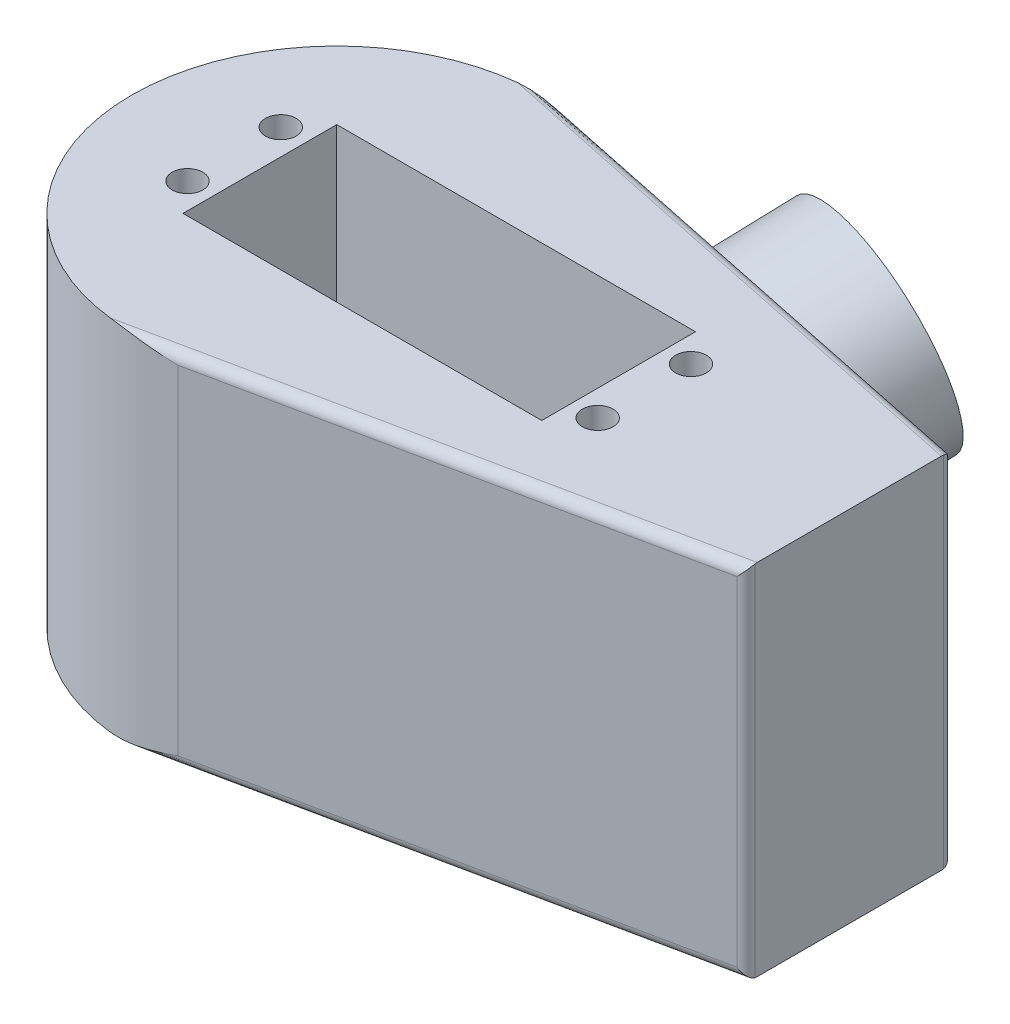
ISO-10303-21;
HEADER;
FILE_DESCRIPTION(('STEP AP214'),'2;1');
FILE_NAME('part.step','',(''),(''),'','','');
FILE_SCHEMA(('AUTOMOTIVE_DESIGN { 1 0 10303 214 1 1 1 1 }'));
ENDSEC;
DATA;
#1=APPLICATION_CONTEXT('core data for automotive mechanical design processes');
#2=APPLICATION_PROTOCOL_DEFINITION('international standard','automotive_design',2000,#1);
#3=PRODUCT_CONTEXT('',#1,'mechanical');
#4=PRODUCT('Part','Part','',(#3));
#5=PRODUCT_RELATED_PRODUCT_CATEGORY('part','',(#4));
#6=PRODUCT_DEFINITION_FORMATION('','',#4);
#7=PRODUCT_DEFINITION_CONTEXT('part definition',#1,'design');
#8=PRODUCT_DEFINITION('design','',#6,#7);
#9=PRODUCT_DEFINITION_SHAPE('','',#8);
#10=(LENGTH_UNIT() NAMED_UNIT(*) SI_UNIT(.MILLI.,.METRE.));
#11=(NAMED_UNIT(*) PLANE_ANGLE_UNIT() SI_UNIT($,.RADIAN.));
#12=(NAMED_UNIT(*) SI_UNIT($,.STERADIAN.) SOLID_ANGLE_UNIT());
#13=UNCERTAINTY_MEASURE_WITH_UNIT(LENGTH_MEASURE(1.E-05),#10,'distance_accuracy_value','');
#14=(GEOMETRIC_REPRESENTATION_CONTEXT(3) GLOBAL_UNCERTAINTY_ASSIGNED_CONTEXT((#13)) GLOBAL_UNIT_ASSIGNED_CONTEXT((#10,
#11,#12)) REPRESENTATION_CONTEXT('',''));
#15=CARTESIAN_POINT('',(0.,0.,0.));
#16=DIRECTION('',(0.,0.,1.));
#17=DIRECTION('',(1.,0.,0.));
#18=AXIS2_PLACEMENT_3D('',#15,#16,#17);
#19=CARTESIAN_POINT('',(0.,35.,-55.));
#20=DIRECTION('',(0.,-1.,0.));
#21=DIRECTION('',(0.,0.,1.));
#22=AXIS2_PLACEMENT_3D('',#19,#20,#21);
#23=CYLINDRICAL_SURFACE('',#22,20.);
#24=CARTESIAN_POINT('',(0.,35.,-55.));
#25=DIRECTION('',(0.,-1.,0.));
#26=DIRECTION('',(0.,0.,-1.));
#27=AXIS2_PLACEMENT_3D('',#24,#25,#26);
#28=CIRCLE('',#27,20.);
#29=CARTESIAN_POINT('',(-2.2333107920081,35.,-35.1250830717132));
#30=VERTEX_POINT('',#29);
#31=CARTESIAN_POINT('',(-2.23331079200801,35.,-74.8749169282868));
#32=VERTEX_POINT('',#31);
#33=EDGE_CURVE('E191',#30,#32,#28,.T.);
#34=ORIENTED_EDGE('',*,*,#33,.T.);
#35=CARTESIAN_POINT('',(-2.23331079200801,35.,-74.8749169282868));
#36=CARTESIAN_POINT('',(-2.14996907357093,34.9999950767671,-74.8842821194228));
#37=CARTESIAN_POINT('',(-2.06657545336633,34.998971904392,-74.8931218404145));
#38=CARTESIAN_POINT('',(-1.89973454127592,34.9950834396215,-74.9097472148043));
#39=CARTESIAN_POINT('',(-1.81628725619466,34.9922183470936,-74.9175329824564));
#40=CARTESIAN_POINT('',(-1.56602084017878,34.9811560983058,-74.9392981586653));
#41=CARTESIAN_POINT('',(-1.39916930294379,34.9704914609071,-74.9516975519698));
#42=CARTESIAN_POINT('',(-1.06584594714328,34.9437956167236,-74.9722764466726));
#43=CARTESIAN_POINT('',(-0.899373912551401,34.9277705786574,-74.9804607713778));
#44=CARTESIAN_POINT('',(-0.566738303897362,34.8912643836756,-74.9926616357295));
#45=CARTESIAN_POINT('',(-0.400574812968888,34.8707821637801,-74.9966771798555));
#46=CARTESIAN_POINT('',(0.128809122322126,34.7995709639234,-75.0028867233304));
#47=CARTESIAN_POINT('',(0.491220352464049,34.7418534786272,-74.99722650781));
#48=CARTESIAN_POINT('',(1.21313243878922,34.614782264799,-74.9664467676819));
#49=CARTESIAN_POINT('',(1.5726320780209,34.5454239097815,-74.9413194917747));
#50=CARTESIAN_POINT('',(2.64646781571053,34.326563565978,-74.8371721412846));
#51=CARTESIAN_POINT('',(3.35617771041687,34.1662703511847,-74.7293869136484));
#52=CARTESIAN_POINT('',(4.06628044528317,34.0041146958639,-74.5822738180682));
#53=CARTESIAN_POINT('',(4.07528872144488,34.0020573163571,-74.5804010779713));
#54=CARTESIAN_POINT('',(4.08429556936663,34.,-74.5785221531671));
#55=B_SPLINE_CURVE_WITH_KNOTS('',3,(#35,#36,#37,#38,#39,#40,#41,#42,#43,#44,#45,#46,#47,#48,#49,
#50,#51,#52,#53,#54),.UNSPECIFIED.,.F.,.F.,(4,2,2,2,2,2,2,2,2,4),(0.,0.251579466840216,
0.503131639289502,1.00591075695084,1.50811325849014,2.01043566031304,3.11052898446647,
4.21106056370253,6.41201196552981,6.44029624320447),.UNSPECIFIED.);
#56=CARTESIAN_POINT('',(4.08429556936663,34.,-74.5785221531671));
#57=VERTEX_POINT('',#56);
#58=EDGE_CURVE('E244',#57,#32,#55,.F.);
#59=ORIENTED_EDGE('',*,*,#58,.F.);
#60=DIRECTION('',(0.,-1.,0.));
#61=VECTOR('',#60,1.);
#62=CARTESIAN_POINT('',(4.08429556936663,35.,-74.5785221531671));
#63=LINE('',#62,#61);
#64=CARTESIAN_POINT('',(4.08429556936663,1.,-74.5785221531671));
#65=VERTEX_POINT('',#64);
#66=EDGE_CURVE('E205',#57,#65,#63,.T.);
#67=ORIENTED_EDGE('',*,*,#66,.T.);
#68=CARTESIAN_POINT('',(-2.23331079200801,0.,-74.8749169282868));
#69=CARTESIAN_POINT('',(-2.14996907357087,4.92323291417513E-06,-74.8842821194228));
#70=CARTESIAN_POINT('',(-2.0665754533662,0.00102809560798269,-74.8931218404145));
#71=CARTESIAN_POINT('',(-1.89973454127567,0.00491656037851031,-74.9097472148043));
#72=CARTESIAN_POINT('',(-1.81628725619435,0.00778165290641086,-74.9175329824564));
#73=CARTESIAN_POINT('',(-1.56602084017831,0.0188439016942182,-74.9392981586653));
#74=CARTESIAN_POINT('',(-1.39916930294322,0.0295085390929364,-74.9516975519699));
#75=CARTESIAN_POINT('',(-1.06584594714274,0.0562043832764797,-74.9722764466726));
#76=CARTESIAN_POINT('',(-0.899373912550977,0.0722294213426533,-74.9804607713778));
#77=CARTESIAN_POINT('',(-0.566738303897156,0.10873561632441,-74.9926616357295));
#78=CARTESIAN_POINT('',(-0.400574812968779,0.129217836219925,-74.9966771798555));
#79=CARTESIAN_POINT('',(0.128809122322075,0.20042903607671,-75.0028867233304));
#80=CARTESIAN_POINT('',(0.491220352463882,0.2581465213732,-74.99722650781));
#81=CARTESIAN_POINT('',(1.21313243878911,0.385217735200488,-74.9664467676819));
#82=CARTESIAN_POINT('',(1.57263207802098,0.454576090216708,-74.9413194917747));
#83=CARTESIAN_POINT('',(2.64646781570953,0.67343643402529,-74.8371721412847));
#84=CARTESIAN_POINT('',(3.35617771041266,0.833729648833808,-74.729386913649));
#85=CARTESIAN_POINT('',(4.06628044528312,0.995885304136537,-74.5822738180682));
#86=CARTESIAN_POINT('',(4.07528872144487,0.997942683643127,-74.5804010779713));
#87=CARTESIAN_POINT('',(4.08429556936667,1.,-74.5785221531671));
#88=B_SPLINE_CURVE_WITH_KNOTS('',3,(#68,#69,#70,#71,#72,#73,#74,#75,#76,#77,#78,#79,#80,#81,#82,
#83,#84,#85,#86,#87),.UNSPECIFIED.,.F.,.F.,(4,2,2,2,2,2,2,2,2,4),(0.,0.251579466840405,
0.503131639289877,1.00591075695151,1.50811325849045,2.01043566031304,3.11052898446636,
4.21106056370212,6.41201196552987,6.4402962432045),.UNSPECIFIED.);
#89=CARTESIAN_POINT('',(-2.23331079200801,0.,-74.8749169282868));
#90=VERTEX_POINT('',#89);
#91=EDGE_CURVE('E236',#90,#65,#88,.T.);
#92=ORIENTED_EDGE('',*,*,#91,.F.);
#93=CARTESIAN_POINT('',(0.,0.,-55.));
#94=DIRECTION('',(0.,-1.,0.));
#95=DIRECTION('',(0.,0.,-1.));
#96=AXIS2_PLACEMENT_3D('',#93,#94,#95);
#97=CIRCLE('',#96,20.);
#98=CARTESIAN_POINT('',(-2.2333107920081,0.,-35.1250830717132));
#99=VERTEX_POINT('',#98);
#100=EDGE_CURVE('E187',#99,#90,#97,.T.);
#101=ORIENTED_EDGE('',*,*,#100,.F.);
#102=CARTESIAN_POINT('',(-2.2333107920081,0.,-35.1250830717132));
#103=CARTESIAN_POINT('',(-2.14996907357066,4.92323291338114E-06,-35.1157178805772));
#104=CARTESIAN_POINT('',(-2.06657545336569,0.00102809560798992,-35.1068781595855));
#105=CARTESIAN_POINT('',(-1.89973454127456,0.00491656037854607,-35.0902527851956));
#106=CARTESIAN_POINT('',(-1.81628725619293,0.00778165290646713,-35.0824670175435));
#107=CARTESIAN_POINT('',(-1.56602084017612,0.018843901694341,-35.0607018413345));
#108=CARTESIAN_POINT('',(-1.39916930294056,0.0295085390931108,-35.04830244803));
#109=CARTESIAN_POINT('',(-1.06584594714019,0.056204383276741,-35.0277235533272));
#110=CARTESIAN_POINT('',(-0.899373912549017,0.072229421342916,-35.0195392286221));
#111=CARTESIAN_POINT('',(-0.566738303896248,0.108735616324489,-35.0073383642705));
#112=CARTESIAN_POINT('',(-0.400574812968337,0.129217836219819,-35.0033228201445));
#113=CARTESIAN_POINT('',(0.128809122321731,0.20042903607708,-34.9971132766696));
#114=CARTESIAN_POINT('',(0.491220352462968,0.258146521375392,-35.0027734921899));
#115=CARTESIAN_POINT('',(1.21313243878852,0.385217735198099,-35.0335532323182));
#116=CARTESIAN_POINT('',(1.57263207802129,0.454576090207902,-35.0586805082257));
#117=CARTESIAN_POINT('',(2.64646781570446,0.673436434042161,-35.1628278587141));
#118=CARTESIAN_POINT('',(3.35617771039161,0.833729648927437,-35.2706130863458));
#119=CARTESIAN_POINT('',(4.06628044528254,0.995885304138937,-35.4177261819317));
#120=CARTESIAN_POINT('',(4.07528872144455,0.997942683644341,-35.4195989220287));
#121=CARTESIAN_POINT('',(4.08429556936661,1.,-35.4214778468329));
#122=B_SPLINE_CURVE_WITH_KNOTS('',3,(#102,#103,#104,#105,#106,#107,#108,#109,#110,#111,#112,
#113,#114,#115,#116,#117,#118,#119,#120,#121),.UNSPECIFIED.,.F.,.F.,(4,2,2,2,2,2,2,2,2,4),(0.,
0.251579466841312,0.503131639291695,1.00591075695474,1.50811325849194,2.01043566031304,
3.11052898446585,4.21106056370015,6.41201196552988,6.44029624320452),.UNSPECIFIED.);
#123=CARTESIAN_POINT('',(4.08429556936661,1.,-35.4214778468329));
#124=VERTEX_POINT('',#123);
#125=EDGE_CURVE('E264',#124,#99,#122,.F.);
#126=ORIENTED_EDGE('',*,*,#125,.F.);
#127=DIRECTION('',(0.,-1.,0.));
#128=VECTOR('',#127,1.);
#129=CARTESIAN_POINT('',(4.08429556936661,35.,-35.4214778468329));
#130=LINE('',#129,#128);
#131=CARTESIAN_POINT('',(4.08429556936661,34.,-35.4214778468329));
#132=VERTEX_POINT('',#131);
#133=EDGE_CURVE('E198',#132,#124,#130,.T.);
#134=ORIENTED_EDGE('',*,*,#133,.F.);
#135=CARTESIAN_POINT('',(-2.2333107920081,35.,-35.1250830717132));
#136=CARTESIAN_POINT('',(-2.14996907357066,34.9999950767671,-35.1157178805772));
#137=CARTESIAN_POINT('',(-2.06657545336571,34.998971904392,-35.1068781595855));
#138=CARTESIAN_POINT('',(-1.89973454127459,34.9950834396215,-35.0902527851956));
#139=CARTESIAN_POINT('',(-1.81628725619297,34.9922183470935,-35.0824670175435));
#140=CARTESIAN_POINT('',(-1.56602084017618,34.9811560983057,-35.0607018413345));
#141=CARTESIAN_POINT('',(-1.39916930294064,34.9704914609069,-35.04830244803));
#142=CARTESIAN_POINT('',(-1.06584594714026,34.9437956167233,-35.0277235533273));
#143=CARTESIAN_POINT('',(-0.899373912549073,34.9277705786571,-35.0195392286221));
#144=CARTESIAN_POINT('',(-0.566738303896276,34.8912643836755,-35.0073383642705));
#145=CARTESIAN_POINT('',(-0.400574812968352,34.8707821637802,-35.0033228201445));
#146=CARTESIAN_POINT('',(0.128809122321738,34.7995709639229,-34.9971132766696));
#147=CARTESIAN_POINT('',(0.49122035246299,34.7418534786247,-35.0027734921899));
#148=CARTESIAN_POINT('',(1.21313243878853,34.6147822648018,-35.0335532323182));
#149=CARTESIAN_POINT('',(1.57263207802127,34.5454239097918,-35.0586805082256));
#150=CARTESIAN_POINT('',(2.6464678157046,34.3265635659584,-35.1628278587142));
#151=CARTESIAN_POINT('',(3.35617771039222,34.1662703510754,-35.2706130863462));
#152=CARTESIAN_POINT('',(4.06628044528256,34.0041146958611,-35.4177261819317));
#153=CARTESIAN_POINT('',(4.07528872144456,34.0020573163557,-35.4195989220287));
#154=CARTESIAN_POINT('',(4.08429556936661,34.,-35.4214778468329));
#155=B_SPLINE_CURVE_WITH_KNOTS('',3,(#135,#136,#137,#138,#139,#140,#141,#142,#143,#144,#145,
#146,#147,#148,#149,#150,#151,#152,#153,#154),.UNSPECIFIED.,.F.,.F.,(4,2,2,2,2,2,2,2,2,4),(0.,
0.251579466841288,0.503131639291647,1.00591075695466,1.5081132584919,2.01043566031304,
3.11052898446586,4.2110605637002,6.41201196552989,6.44029624320452),.UNSPECIFIED.);
#156=EDGE_CURVE('E270',#30,#132,#155,.T.);
#157=ORIENTED_EDGE('',*,*,#156,.F.);
#158=EDGE_LOOP('',(#34,#59,#67,#92,#101,#126,#134,#157));
#159=FACE_BOUND('',#158,.T.);
#160=ADVANCED_FACE('F42',(#159),#23,.T.);
#161=CARTESIAN_POINT('',(50.,35.,-65.));
#162=DIRECTION('',(-0.204214778468331,0.,0.978926107658352));
#163=DIRECTION('',(-0.978926107658352,0.,-0.204214778468331));
#164=AXIS2_PLACEMENT_3D('',#161,#162,#163);
#165=PLANE('',#164);
#166=CARTESIAN_POINT('',(16.7947498943146,15.4452766950134,-71.926981251464));
#167=DIRECTION('',(0.204214778468331,0.,-0.978926107658352));
#168=DIRECTION('',(-0.108974946633632,-0.99378451117643,-0.0227333752887835));
#169=AXIS2_PLACEMENT_3D('',#166,#167,#168);
#170=ELLIPSE('',#169,10.8799883148223,10.5);
#171=CARTESIAN_POINT('',(15.6091037483323,4.63291282596247,-72.1743201089625));
#172=VERTEX_POINT('',#171);
#173=EDGE_CURVE('E12',#172,#172,#170,.F.);
#174=ORIENTED_EDGE('',*,*,#173,.T.);
#175=EDGE_LOOP('',(#174));
#176=FACE_BOUND('',#175,.T.);
#177=DIRECTION('',(0.,-1.,0.));
#178=VECTOR('',#177,1.);
#179=CARTESIAN_POINT('',(49.2042147784683,35.,-65.1660095705407));
#180=LINE('',#179,#178);
#181=CARTESIAN_POINT('',(49.2042147784683,1.,-65.1660095705407));
#182=VERTEX_POINT('',#181);
#183=CARTESIAN_POINT('',(49.2042147784683,34.,-65.1660095705407));
#184=VERTEX_POINT('',#183);
#185=EDGE_CURVE('E314',#182,#184,#180,.F.);
#186=ORIENTED_EDGE('',*,*,#185,.F.);
#187=DIRECTION('',(0.978926107658352,0.,0.204214778468331));
#188=VECTOR('',#187,1.);
#189=CARTESIAN_POINT('',(50.,1.,-65.));
#190=LINE('',#189,#188);
#191=EDGE_CURVE('E313',#65,#182,#190,.T.);
#192=ORIENTED_EDGE('',*,*,#191,.F.);
#193=ORIENTED_EDGE('',*,*,#66,.F.);
#194=DIRECTION('',(0.978926107658352,0.,0.204214778468331));
#195=VECTOR('',#194,1.);
#196=CARTESIAN_POINT('',(4.08429556936663,34.,-74.5785221531671));
#197=LINE('',#196,#195);
#198=EDGE_CURVE('E51',#184,#57,#197,.F.);
#199=ORIENTED_EDGE('',*,*,#198,.F.);
#200=EDGE_LOOP('',(#186,#192,#193,#199));
#201=FACE_BOUND('',#200,.T.);
#202=ADVANCED_FACE('F255',(#176,#201),#165,.F.);
#203=CARTESIAN_POINT('',(50.,35.,-45.));
#204=DIRECTION('',(-1.,0.,0.));
#205=DIRECTION('',(0.,0.,-1.));
#206=AXIS2_PLACEMENT_3D('',#203,#204,#205);
#207=PLANE('',#206);
#208=DIRECTION('',(0.,-1.,0.));
#209=VECTOR('',#208,1.);
#210=CARTESIAN_POINT('',(50.,35.,-45.8129165371176));
#211=LINE('',#210,#209);
#212=CARTESIAN_POINT('',(50.,0.0210738923416484,-45.8129165371176));
#213=VERTEX_POINT('',#212);
#214=CARTESIAN_POINT('',(50.,34.9789261076584,-45.8129165371176));
#215=VERTEX_POINT('',#214);
#216=EDGE_CURVE('E226',#213,#215,#211,.F.);
#217=ORIENTED_EDGE('',*,*,#216,.F.);
#218=CARTESIAN_POINT('',(50.,1.,-46.0215275618627));
#219=DIRECTION('',(1.,0.,0.));
#220=DIRECTION('',(0.,0.,1.));
#221=AXIS2_PLACEMENT_3D('',#218,#219,#220);
#222=ELLIPSE('',#221,1.02152756186272,1.);
#223=CARTESIAN_POINT('',(50.,0.,-46.0215275618627));
#224=VERTEX_POINT('',#223);
#225=EDGE_CURVE('E223',#224,#213,#222,.F.);
#226=ORIENTED_EDGE('',*,*,#225,.F.);
#227=DIRECTION('',(0.,0.,1.));
#228=VECTOR('',#227,1.);
#229=CARTESIAN_POINT('',(50.,0.,-45.));
#230=LINE('',#229,#228);
#231=CARTESIAN_POINT('',(50.,0.,-63.9784724381373));
#232=VERTEX_POINT('',#231);
#233=EDGE_CURVE('E195',#232,#224,#230,.T.);
#234=ORIENTED_EDGE('',*,*,#233,.F.);
#235=CARTESIAN_POINT('',(50.,1.,-63.9784724381373));
#236=DIRECTION('',(1.,0.,0.));
#237=DIRECTION('',(0.,0.,1.));
#238=AXIS2_PLACEMENT_3D('',#235,#236,#237);
#239=ELLIPSE('',#238,1.02152756186272,1.);
#240=CARTESIAN_POINT('',(50.,0.0210738923416484,-64.1870834628824));
#241=VERTEX_POINT('',#240);
#242=EDGE_CURVE('E216',#241,#232,#239,.F.);
#243=ORIENTED_EDGE('',*,*,#242,.F.);
#244=DIRECTION('',(0.,-1.,0.));
#245=VECTOR('',#244,1.);
#246=CARTESIAN_POINT('',(50.,35.,-64.1870834628824));
#247=LINE('',#246,#245);
#248=CARTESIAN_POINT('',(50.,34.9789261076584,-64.1870834628824));
#249=VERTEX_POINT('',#248);
#250=EDGE_CURVE('E219',#249,#241,#247,.T.);
#251=ORIENTED_EDGE('',*,*,#250,.F.);
#252=CARTESIAN_POINT('',(50.,34.,-63.9784724381373));
#253=DIRECTION('',(1.,0.,0.));
#254=DIRECTION('',(0.,0.,-1.));
#255=AXIS2_PLACEMENT_3D('',#252,#253,#254);
#256=ELLIPSE('',#255,1.02152756186272,1.);
#257=CARTESIAN_POINT('',(50.,35.,-63.9784724381373));
#258=VERTEX_POINT('',#257);
#259=EDGE_CURVE('E221',#258,#249,#256,.F.);
#260=ORIENTED_EDGE('',*,*,#259,.F.);
#261=DIRECTION('',(0.,0.,1.));
#262=VECTOR('',#261,1.);
#263=CARTESIAN_POINT('',(50.,35.,-45.));
#264=LINE('',#263,#262);
#265=CARTESIAN_POINT('',(50.,35.,-46.0215275618627));
#266=VERTEX_POINT('',#265);
#267=EDGE_CURVE('E194',#258,#266,#264,.T.);
#268=ORIENTED_EDGE('',*,*,#267,.T.);
#269=CARTESIAN_POINT('',(50.,34.,-46.0215275618627));
#270=DIRECTION('',(1.,0.,0.));
#271=DIRECTION('',(0.,0.,-1.));
#272=AXIS2_PLACEMENT_3D('',#269,#270,#271);
#273=ELLIPSE('',#272,1.02152756186272,1.);
#274=EDGE_CURVE('E229',#215,#266,#273,.F.);
#275=ORIENTED_EDGE('',*,*,#274,.F.);
#276=EDGE_LOOP('',(#217,#226,#234,#243,#251,#260,#268,#275));
#277=FACE_BOUND('',#276,.T.);
#278=ADVANCED_FACE('F386',(#277),#207,.F.);
#279=CARTESIAN_POINT('',(4.08429556936661,35.,-35.4214778468329));
#280=DIRECTION('',(-0.20421477846833,0.,-0.978926107658352));
#281=DIRECTION('',(0.978926107658352,0.,-0.20421477846833));
#282=AXIS2_PLACEMENT_3D('',#279,#280,#281);
#283=PLANE('',#282);
#284=ORIENTED_EDGE('',*,*,#133,.T.);
#285=DIRECTION('',(-0.978926107658352,0.,0.20421477846833));
#286=VECTOR('',#285,1.);
#287=CARTESIAN_POINT('',(4.08429556936661,1.,-35.4214778468329));
#288=LINE('',#287,#286);
#289=CARTESIAN_POINT('',(49.2042147784683,1.,-44.8339904294593));
#290=VERTEX_POINT('',#289);
#291=EDGE_CURVE('E208',#290,#124,#288,.T.);
#292=ORIENTED_EDGE('',*,*,#291,.F.);
#293=DIRECTION('',(0.,-1.,0.));
#294=VECTOR('',#293,1.);
#295=CARTESIAN_POINT('',(49.2042147784683,35.,-44.8339904294593));
#296=LINE('',#295,#294);
#297=CARTESIAN_POINT('',(49.2042147784683,34.,-44.8339904294593));
#298=VERTEX_POINT('',#297);
#299=EDGE_CURVE('E210',#298,#290,#296,.T.);
#300=ORIENTED_EDGE('',*,*,#299,.F.);
#301=DIRECTION('',(-0.978926107658352,0.,0.20421477846833));
#302=VECTOR('',#301,1.);
#303=CARTESIAN_POINT('',(50.,34.,-45.));
#304=LINE('',#303,#302);
#305=EDGE_CURVE('E213',#132,#298,#304,.F.);
#306=ORIENTED_EDGE('',*,*,#305,.F.);
#307=EDGE_LOOP('',(#284,#292,#300,#306));
#308=FACE_BOUND('',#307,.T.);
#309=ADVANCED_FACE('F381',(#308),#283,.F.);
#310=CARTESIAN_POINT('',(0.,35.,-55.));
#311=DIRECTION('',(0.,1.,0.));
#312=DIRECTION('',(0.,0.,-1.));
#313=AXIS2_PLACEMENT_3D('',#310,#311,#312);
#314=PLANE('',#313);
#315=CARTESIAN_POINT('',(30.01,35.,-50.45));
#316=DIRECTION('',(0.,-1.,0.));
#317=DIRECTION('',(0.,0.,1.));
#318=AXIS2_PLACEMENT_3D('',#315,#316,#317);
#319=CIRCLE('',#318,1.5);
#320=CARTESIAN_POINT('',(30.01,35.,-48.95));
#321=VERTEX_POINT('',#320);
#322=EDGE_CURVE('E542',#321,#321,#319,.T.);
#323=ORIENTED_EDGE('',*,*,#322,.T.);
#324=EDGE_LOOP('',(#323));
#325=FACE_BOUND('',#324,.T.);
#326=CARTESIAN_POINT('',(30.01,35.,-59.55));
#327=DIRECTION('',(0.,-1.,0.));
#328=DIRECTION('',(0.,0.,-1.));
#329=AXIS2_PLACEMENT_3D('',#326,#327,#328);
#330=CIRCLE('',#329,1.5);
#331=CARTESIAN_POINT('',(30.01,35.,-61.05));
#332=VERTEX_POINT('',#331);
#333=EDGE_CURVE('E541',#332,#332,#330,.T.);
#334=ORIENTED_EDGE('',*,*,#333,.T.);
#335=EDGE_LOOP('',(#334));
#336=FACE_BOUND('',#335,.T.);
#337=CARTESIAN_POINT('',(-10.01,35.,-59.55));
#338=DIRECTION('',(0.,-1.,0.));
#339=DIRECTION('',(0.,0.,1.));
#340=AXIS2_PLACEMENT_3D('',#337,#338,#339);
#341=CIRCLE('',#340,1.5);
#342=CARTESIAN_POINT('',(-10.01,35.,-58.05));
#343=VERTEX_POINT('',#342);
#344=EDGE_CURVE('E558',#343,#343,#341,.T.);
#345=ORIENTED_EDGE('',*,*,#344,.T.);
#346=EDGE_LOOP('',(#345));
#347=FACE_BOUND('',#346,.T.);
#348=CARTESIAN_POINT('',(-10.01,35.,-50.45));
#349=DIRECTION('',(0.,-1.,0.));
#350=DIRECTION('',(0.,0.,-1.));
#351=AXIS2_PLACEMENT_3D('',#348,#349,#350);
#352=CIRCLE('',#351,1.5);
#353=CARTESIAN_POINT('',(-10.01,35.,-51.95));
#354=VERTEX_POINT('',#353);
#355=EDGE_CURVE('E552',#354,#354,#352,.T.);
#356=ORIENTED_EDGE('',*,*,#355,.T.);
#357=EDGE_LOOP('',(#356));
#358=FACE_BOUND('',#357,.T.);
#359=DIRECTION('',(0.,0.,-1.));
#360=VECTOR('',#359,1.);
#361=CARTESIAN_POINT('',(-7.5,35.,-47.5));
#362=LINE('',#361,#360);
#363=CARTESIAN_POINT('',(-7.5,35.,-47.5));
#364=VERTEX_POINT('',#363);
#365=CARTESIAN_POINT('',(-7.5,35.,-62.5));
#366=VERTEX_POINT('',#365);
#367=EDGE_CURVE('E180',#364,#366,#362,.T.);
#368=ORIENTED_EDGE('',*,*,#367,.T.);
#369=DIRECTION('',(1.,0.,0.));
#370=VECTOR('',#369,1.);
#371=CARTESIAN_POINT('',(-7.5,35.,-62.5));
#372=LINE('',#371,#370);
#373=CARTESIAN_POINT('',(27.5,35.,-62.5));
#374=VERTEX_POINT('',#373);
#375=EDGE_CURVE('E160',#366,#374,#372,.T.);
#376=ORIENTED_EDGE('',*,*,#375,.T.);
#377=DIRECTION('',(0.,0.,1.));
#378=VECTOR('',#377,1.);
#379=CARTESIAN_POINT('',(27.5,35.,-47.5));
#380=LINE('',#379,#378);
#381=CARTESIAN_POINT('',(27.5,35.,-47.5));
#382=VERTEX_POINT('',#381);
#383=EDGE_CURVE('E172',#374,#382,#380,.T.);
#384=ORIENTED_EDGE('',*,*,#383,.T.);
#385=DIRECTION('',(-1.,0.,0.));
#386=VECTOR('',#385,1.);
#387=CARTESIAN_POINT('',(-7.5,35.,-47.5));
#388=LINE('',#387,#386);
#389=EDGE_CURVE('E169',#382,#364,#388,.T.);
#390=ORIENTED_EDGE('',*,*,#389,.T.);
#391=EDGE_LOOP('',(#368,#376,#384,#390));
#392=FACE_BOUND('',#391,.T.);
#393=ORIENTED_EDGE('',*,*,#267,.F.);
#394=DIRECTION('',(0.978926107658352,0.,0.204214778468331));
#395=VECTOR('',#394,1.);
#396=CARTESIAN_POINT('',(49.7957852215317,35.,-64.0210738923416));
#397=LINE('',#396,#395);
#398=EDGE_CURVE('E232',#32,#258,#397,.T.);
#399=ORIENTED_EDGE('',*,*,#398,.F.);
#400=ORIENTED_EDGE('',*,*,#33,.F.);
#401=DIRECTION('',(-0.978926107658352,0.,0.20421477846833));
#402=VECTOR('',#401,1.);
#403=CARTESIAN_POINT('',(3.88008079089828,35.,-36.4004039544913));
#404=LINE('',#403,#402);
#405=EDGE_CURVE('E234',#266,#30,#404,.T.);
#406=ORIENTED_EDGE('',*,*,#405,.F.);
#407=EDGE_LOOP('',(#393,#399,#400,#406));
#408=FACE_BOUND('',#407,.T.);
#409=ADVANCED_FACE('F378',(#325,#336,#347,#358,#392,#408),#314,.T.);
#410=CARTESIAN_POINT('',(0.,0.,-55.));
#411=DIRECTION('',(0.,1.,0.));
#412=DIRECTION('',(0.,0.,-1.));
#413=AXIS2_PLACEMENT_3D('',#410,#411,#412);
#414=PLANE('',#413);
#415=CARTESIAN_POINT('',(0.,0.,-55.));
#416=DIRECTION('',(0.,1.,0.));
#417=DIRECTION('',(0.,0.,1.));
#418=AXIS2_PLACEMENT_3D('',#415,#416,#417);
#419=CIRCLE('',#418,7.5);
#420=CARTESIAN_POINT('',(0.,0.,-47.5));
#421=VERTEX_POINT('',#420);
#422=EDGE_CURVE('E175',#421,#421,#419,.T.);
#423=ORIENTED_EDGE('',*,*,#422,.T.);
#424=EDGE_LOOP('',(#423));
#425=FACE_BOUND('',#424,.T.);
#426=ORIENTED_EDGE('',*,*,#100,.T.);
#427=DIRECTION('',(0.978926107658352,0.,0.204214778468331));
#428=VECTOR('',#427,1.);
#429=CARTESIAN_POINT('',(3.8800807908983,0.,-73.5995960455087));
#430=LINE('',#429,#428);
#431=EDGE_CURVE('E299',#232,#90,#430,.F.);
#432=ORIENTED_EDGE('',*,*,#431,.F.);
#433=ORIENTED_EDGE('',*,*,#233,.T.);
#434=DIRECTION('',(-0.978926107658352,0.,0.20421477846833));
#435=VECTOR('',#434,1.);
#436=CARTESIAN_POINT('',(3.88008079089828,0.,-36.4004039544913));
#437=LINE('',#436,#435);
#438=EDGE_CURVE('E304',#99,#224,#437,.F.);
#439=ORIENTED_EDGE('',*,*,#438,.F.);
#440=EDGE_LOOP('',(#426,#432,#433,#439));
#441=FACE_BOUND('',#440,.T.);
#442=ADVANCED_FACE('F306',(#425,#441),#414,.F.);
#443=CARTESIAN_POINT('',(-7.5,20.,-47.5));
#444=DIRECTION('',(-1.,0.,0.));
#445=DIRECTION('',(0.,0.,-1.));
#446=AXIS2_PLACEMENT_3D('',#443,#444,#445);
#447=PLANE('',#446);
#448=ORIENTED_EDGE('',*,*,#367,.F.);
#449=DIRECTION('',(0.,1.,0.));
#450=VECTOR('',#449,1.);
#451=CARTESIAN_POINT('',(-7.5,20.,-47.5));
#452=LINE('',#451,#450);
#453=CARTESIAN_POINT('',(-7.5,20.,-47.5));
#454=VERTEX_POINT('',#453);
#455=EDGE_CURVE('E168',#454,#364,#452,.T.);
#456=ORIENTED_EDGE('',*,*,#455,.F.);
#457=DIRECTION('',(0.,0.,-1.));
#458=VECTOR('',#457,1.);
#459=CARTESIAN_POINT('',(-7.5,20.,-47.5));
#460=LINE('',#459,#458);
#461=CARTESIAN_POINT('',(-7.5,20.,-62.5));
#462=VERTEX_POINT('',#461);
#463=EDGE_CURVE('E150',#454,#462,#460,.T.);
#464=ORIENTED_EDGE('',*,*,#463,.T.);
#465=DIRECTION('',(0.,1.,0.));
#466=VECTOR('',#465,1.);
#467=CARTESIAN_POINT('',(-7.5,20.,-62.5));
#468=LINE('',#467,#466);
#469=EDGE_CURVE('E157',#462,#366,#468,.T.);
#470=ORIENTED_EDGE('',*,*,#469,.T.);
#471=EDGE_LOOP('',(#448,#456,#464,#470));
#472=FACE_BOUND('',#471,.T.);
#473=ADVANCED_FACE('F167',(#472),#447,.F.);
#474=CARTESIAN_POINT('',(-7.5,20.,-47.5));
#475=DIRECTION('',(0.,0.,1.));
#476=DIRECTION('',(-1.,0.,0.));
#477=AXIS2_PLACEMENT_3D('',#474,#475,#476);
#478=PLANE('',#477);
#479=ORIENTED_EDGE('',*,*,#389,.F.);
#480=DIRECTION('',(0.,1.,0.));
#481=VECTOR('',#480,1.);
#482=CARTESIAN_POINT('',(27.5,20.,-47.5));
#483=LINE('',#482,#481);
#484=CARTESIAN_POINT('',(27.5,20.,-47.5));
#485=VERTEX_POINT('',#484);
#486=EDGE_CURVE('E188',#485,#382,#483,.T.);
#487=ORIENTED_EDGE('',*,*,#486,.F.);
#488=DIRECTION('',(-1.,0.,0.));
#489=VECTOR('',#488,1.);
#490=CARTESIAN_POINT('',(-7.5,20.,-47.5));
#491=LINE('',#490,#489);
#492=EDGE_CURVE('E165',#485,#454,#491,.T.);
#493=ORIENTED_EDGE('',*,*,#492,.T.);
#494=ORIENTED_EDGE('',*,*,#455,.T.);
#495=EDGE_LOOP('',(#479,#487,#493,#494));
#496=FACE_BOUND('',#495,.T.);
#497=ADVANCED_FACE('F366',(#496),#478,.F.);
#498=CARTESIAN_POINT('',(27.5,20.,-47.5));
#499=DIRECTION('',(1.,0.,0.));
#500=DIRECTION('',(0.,0.,1.));
#501=AXIS2_PLACEMENT_3D('',#498,#499,#500);
#502=PLANE('',#501);
#503=ORIENTED_EDGE('',*,*,#383,.F.);
#504=DIRECTION('',(0.,1.,0.));
#505=VECTOR('',#504,1.);
#506=CARTESIAN_POINT('',(27.5,20.,-62.5));
#507=LINE('',#506,#505);
#508=CARTESIAN_POINT('',(27.5,20.,-62.5));
#509=VERTEX_POINT('',#508);
#510=EDGE_CURVE('E164',#509,#374,#507,.T.);
#511=ORIENTED_EDGE('',*,*,#510,.F.);
#512=DIRECTION('',(0.,0.,1.));
#513=VECTOR('',#512,1.);
#514=CARTESIAN_POINT('',(27.5,20.,-47.5));
#515=LINE('',#514,#513);
#516=EDGE_CURVE('E152',#509,#485,#515,.T.);
#517=ORIENTED_EDGE('',*,*,#516,.T.);
#518=ORIENTED_EDGE('',*,*,#486,.T.);
#519=EDGE_LOOP('',(#503,#511,#517,#518));
#520=FACE_BOUND('',#519,.T.);
#521=ADVANCED_FACE('F369',(#520),#502,.F.);
#522=CARTESIAN_POINT('',(-7.5,20.,-62.5));
#523=DIRECTION('',(0.,0.,-1.));
#524=DIRECTION('',(1.,0.,0.));
#525=AXIS2_PLACEMENT_3D('',#522,#523,#524);
#526=PLANE('',#525);
#527=ORIENTED_EDGE('',*,*,#375,.F.);
#528=ORIENTED_EDGE('',*,*,#469,.F.);
#529=DIRECTION('',(1.,0.,0.));
#530=VECTOR('',#529,1.);
#531=CARTESIAN_POINT('',(-7.5,20.,-62.5));
#532=LINE('',#531,#530);
#533=EDGE_CURVE('E145',#462,#509,#532,.T.);
#534=ORIENTED_EDGE('',*,*,#533,.T.);
#535=ORIENTED_EDGE('',*,*,#510,.T.);
#536=EDGE_LOOP('',(#527,#528,#534,#535));
#537=FACE_BOUND('',#536,.T.);
#538=ADVANCED_FACE('F158',(#537),#526,.F.);
#539=CARTESIAN_POINT('',(0.,20.,-55.));
#540=DIRECTION('',(0.,1.,0.));
#541=DIRECTION('',(0.,0.,-1.));
#542=AXIS2_PLACEMENT_3D('',#539,#540,#541);
#543=PLANE('',#542);
#544=CARTESIAN_POINT('',(0.,20.,-55.));
#545=DIRECTION('',(0.,-1.,0.));
#546=DIRECTION('',(0.,0.,-1.));
#547=AXIS2_PLACEMENT_3D('',#544,#545,#546);
#548=CIRCLE('',#547,3.);
#549=CARTESIAN_POINT('',(0.,20.,-58.));
#550=VERTEX_POINT('',#549);
#551=EDGE_CURVE('E328',#550,#550,#548,.T.);
#552=ORIENTED_EDGE('',*,*,#551,.T.);
#553=EDGE_LOOP('',(#552));
#554=FACE_BOUND('',#553,.T.);
#555=ORIENTED_EDGE('',*,*,#463,.F.);
#556=ORIENTED_EDGE('',*,*,#492,.F.);
#557=ORIENTED_EDGE('',*,*,#516,.F.);
#558=ORIENTED_EDGE('',*,*,#533,.F.);
#559=EDGE_LOOP('',(#555,#556,#557,#558));
#560=FACE_BOUND('',#559,.T.);
#561=ADVANCED_FACE('F147',(#554,#560),#543,.T.);
#562=CARTESIAN_POINT('',(3.88008079089828,34.,-36.4004039544913));
#563=DIRECTION('',(0.978926107658352,0.,-0.20421477846833));
#564=DIRECTION('',(0.20421477846833,0.,0.978926107658352));
#565=AXIS2_PLACEMENT_3D('',#562,#563,#564);
#566=CYLINDRICAL_SURFACE('',#565,1.);
#567=ORIENTED_EDGE('',*,*,#405,.T.);
#568=ORIENTED_EDGE('',*,*,#156,.T.);
#569=ORIENTED_EDGE('',*,*,#305,.T.);
#570=CARTESIAN_POINT('',(49.,34.,-45.8129165371176));
#571=DIRECTION('',(-0.692205289005773,0.707106781186547,0.144401654673465));
#572=DIRECTION('',(0.692205289005773,0.707106781186547,-0.144401654673465));
#573=AXIS2_PLACEMENT_3D('',#570,#571,#572);
#574=ELLIPSE('',#573,1.41421356237309,1.);
#575=EDGE_CURVE('E182',#298,#215,#574,.T.);
#576=ORIENTED_EDGE('',*,*,#575,.T.);
#577=ORIENTED_EDGE('',*,*,#274,.T.);
#578=EDGE_LOOP('',(#567,#568,#569,#576,#577));
#579=FACE_BOUND('',#578,.T.);
#580=ADVANCED_FACE('F280',(#579),#566,.T.);
#581=CARTESIAN_POINT('',(3.88008079089828,1.,-36.4004039544913));
#582=DIRECTION('',(-0.978926107658352,0.,0.20421477846833));
#583=DIRECTION('',(-0.20421477846833,0.,-0.978926107658352));
#584=AXIS2_PLACEMENT_3D('',#581,#582,#583);
#585=CYLINDRICAL_SURFACE('',#584,1.);
#586=ORIENTED_EDGE('',*,*,#125,.T.);
#587=ORIENTED_EDGE('',*,*,#438,.T.);
#588=ORIENTED_EDGE('',*,*,#225,.T.);
#589=CARTESIAN_POINT('',(49.,1.,-45.8129165371176));
#590=DIRECTION('',(0.692205289005773,0.707106781186547,-0.144401654673465));
#591=DIRECTION('',(-0.692205289005773,0.707106781186547,0.144401654673465));
#592=AXIS2_PLACEMENT_3D('',#589,#590,#591);
#593=ELLIPSE('',#592,1.41421356237309,1.);
#594=EDGE_CURVE('E320',#213,#290,#593,.F.);
#595=ORIENTED_EDGE('',*,*,#594,.T.);
#596=ORIENTED_EDGE('',*,*,#291,.T.);
#597=EDGE_LOOP('',(#586,#587,#588,#595,#596));
#598=FACE_BOUND('',#597,.T.);
#599=ADVANCED_FACE('F277',(#598),#585,.T.);
#600=CARTESIAN_POINT('',(49.,35.,-45.8129165371176));
#601=DIRECTION('',(0.,-1.,0.));
#602=DIRECTION('',(0.,0.,1.));
#603=AXIS2_PLACEMENT_3D('',#600,#601,#602);
#604=CYLINDRICAL_SURFACE('',#603,1.);
#605=ORIENTED_EDGE('',*,*,#575,.F.);
#606=ORIENTED_EDGE('',*,*,#299,.T.);
#607=ORIENTED_EDGE('',*,*,#594,.F.);
#608=ORIENTED_EDGE('',*,*,#216,.T.);
#609=EDGE_LOOP('',(#605,#606,#607,#608));
#610=FACE_BOUND('',#609,.T.);
#611=ADVANCED_FACE('F258',(#610),#604,.T.);
#612=CARTESIAN_POINT('',(49.7957852215317,1.,-64.0210738923416));
#613=DIRECTION('',(0.978926107658352,0.,0.204214778468331));
#614=DIRECTION('',(-0.204214778468331,0.,0.978926107658352));
#615=AXIS2_PLACEMENT_3D('',#612,#613,#614);
#616=CYLINDRICAL_SURFACE('',#615,1.);
#617=ORIENTED_EDGE('',*,*,#431,.T.);
#618=ORIENTED_EDGE('',*,*,#91,.T.);
#619=ORIENTED_EDGE('',*,*,#191,.T.);
#620=CARTESIAN_POINT('',(49.,1.00000000000001,-64.1870834628824));
#621=DIRECTION('',(-0.692205289005773,-0.707106781186547,-0.144401654673465));
#622=DIRECTION('',(0.692205289005773,-0.707106781186547,0.144401654673465));
#623=AXIS2_PLACEMENT_3D('',#620,#621,#622);
#624=ELLIPSE('',#623,1.41421356237309,1.);
#625=EDGE_CURVE('E66',#182,#241,#624,.T.);
#626=ORIENTED_EDGE('',*,*,#625,.T.);
#627=ORIENTED_EDGE('',*,*,#242,.T.);
#628=EDGE_LOOP('',(#617,#618,#619,#626,#627));
#629=FACE_BOUND('',#628,.T.);
#630=ADVANCED_FACE('F44',(#629),#616,.T.);
#631=CARTESIAN_POINT('',(49.,35.,-64.1870834628824));
#632=DIRECTION('',(0.,-1.,0.));
#633=DIRECTION('',(0.,0.,1.));
#634=AXIS2_PLACEMENT_3D('',#631,#632,#633);
#635=CYLINDRICAL_SURFACE('',#634,1.);
#636=ORIENTED_EDGE('',*,*,#625,.F.);
#637=ORIENTED_EDGE('',*,*,#185,.T.);
#638=CARTESIAN_POINT('',(49.,34.,-64.1870834628824));
#639=DIRECTION('',(-0.692205289005773,0.707106781186547,-0.144401654673465));
#640=DIRECTION('',(-0.692205289005773,-0.707106781186547,-0.144401654673465));
#641=AXIS2_PLACEMENT_3D('',#638,#639,#640);
#642=ELLIPSE('',#641,1.41421356237309,1.);
#643=EDGE_CURVE('E58',#184,#249,#642,.F.);
#644=ORIENTED_EDGE('',*,*,#643,.T.);
#645=ORIENTED_EDGE('',*,*,#250,.T.);
#646=EDGE_LOOP('',(#636,#637,#644,#645));
#647=FACE_BOUND('',#646,.T.);
#648=ADVANCED_FACE('F289',(#647),#635,.T.);
#649=CARTESIAN_POINT('',(3.8800807908983,34.,-73.5995960455087));
#650=DIRECTION('',(-0.978926107658352,0.,-0.204214778468331));
#651=DIRECTION('',(0.204214778468331,0.,-0.978926107658352));
#652=AXIS2_PLACEMENT_3D('',#649,#650,#651);
#653=CYLINDRICAL_SURFACE('',#652,1.);
#654=ORIENTED_EDGE('',*,*,#58,.T.);
#655=ORIENTED_EDGE('',*,*,#398,.T.);
#656=ORIENTED_EDGE('',*,*,#259,.T.);
#657=ORIENTED_EDGE('',*,*,#643,.F.);
#658=ORIENTED_EDGE('',*,*,#198,.T.);
#659=EDGE_LOOP('',(#654,#655,#656,#657,#658));
#660=FACE_BOUND('',#659,.T.);
#661=ADVANCED_FACE('F285',(#660),#653,.T.);
#662=CARTESIAN_POINT('',(0.,10.,-55.));
#663=DIRECTION('',(0.,-1.,0.));
#664=DIRECTION('',(0.,0.,1.));
#665=AXIS2_PLACEMENT_3D('',#662,#663,#664);
#666=CYLINDRICAL_SURFACE('',#665,7.5);
#667=CARTESIAN_POINT('',(0.,10.,-55.));
#668=DIRECTION('',(0.,1.,0.));
#669=DIRECTION('',(0.,0.,1.));
#670=AXIS2_PLACEMENT_3D('',#667,#668,#669);
#671=CIRCLE('',#670,7.5);
#672=CARTESIAN_POINT('',(0.,10.,-47.5));
#673=VERTEX_POINT('',#672);
#674=EDGE_CURVE('E324',#673,#673,#671,.T.);
#675=ORIENTED_EDGE('',*,*,#674,.T.);
#676=EDGE_LOOP('',(#675));
#677=FACE_BOUND('',#676,.T.);
#678=ORIENTED_EDGE('',*,*,#422,.F.);
#679=EDGE_LOOP('',(#678));
#680=FACE_BOUND('',#679,.T.);
#681=ADVANCED_FACE('F288',(#677,#680),#666,.F.);
#682=CARTESIAN_POINT('',(0.,10.,-55.));
#683=DIRECTION('',(0.,-1.,0.));
#684=DIRECTION('',(0.,0.,1.));
#685=AXIS2_PLACEMENT_3D('',#682,#683,#684);
#686=PLANE('',#685);
#687=CARTESIAN_POINT('',(0.,10.,-55.));
#688=DIRECTION('',(0.,1.,0.));
#689=DIRECTION('',(0.,0.,1.));
#690=AXIS2_PLACEMENT_3D('',#687,#688,#689);
#691=CIRCLE('',#690,3.);
#692=CARTESIAN_POINT('',(0.,10.,-52.));
#693=VERTEX_POINT('',#692);
#694=EDGE_CURVE('E326',#693,#693,#691,.T.);
#695=ORIENTED_EDGE('',*,*,#694,.T.);
#696=EDGE_LOOP('',(#695));
#697=FACE_BOUND('',#696,.T.);
#698=ORIENTED_EDGE('',*,*,#674,.F.);
#699=EDGE_LOOP('',(#698));
#700=FACE_BOUND('',#699,.T.);
#701=ADVANCED_FACE('F353',(#697,#700),#686,.T.);
#702=CARTESIAN_POINT('',(0.,35.5341352892988,-55.));
#703=DIRECTION('',(0.,-1.,0.));
#704=DIRECTION('',(0.,0.,1.));
#705=AXIS2_PLACEMENT_3D('',#702,#703,#704);
#706=CYLINDRICAL_SURFACE('',#705,3.);
#707=ORIENTED_EDGE('',*,*,#551,.F.);
#708=EDGE_LOOP('',(#707));
#709=FACE_BOUND('',#708,.T.);
#710=ORIENTED_EDGE('',*,*,#694,.F.);
#711=EDGE_LOOP('',(#710));
#712=FACE_BOUND('',#711,.T.);
#713=ADVANCED_FACE('F358',(#709,#712),#706,.F.);
#714=CARTESIAN_POINT('',(20.4697081544808,19.6856669875086,-87.217334677882));
#715=DIRECTION('',(-0.225631238099938,-0.260347041786367,0.938781104532136));
#716=DIRECTION('',(0.,0.963630453208623,0.267238376078258));
#717=AXIS2_PLACEMENT_3D('',#714,#715,#716);
#718=CYLINDRICAL_SURFACE('',#717,10.5);
#719=CARTESIAN_POINT('',(20.4697081544808,19.6856669875086,-87.217334677882));
#720=DIRECTION('',(-0.225631238099938,-0.260347041786367,0.938781104532136));
#721=DIRECTION('',(0.97421278188776,-0.0602973256623541,0.217425132228266));
#722=AXIS2_PLACEMENT_3D('',#719,#720,#721);
#723=CIRCLE('',#722,10.5);
#724=CARTESIAN_POINT('',(30.6989423643022,19.0525450680539,-84.9343707894852));
#725=VERTEX_POINT('',#724);
#726=EDGE_CURVE('E331',#725,#725,#723,.T.);
#727=ORIENTED_EDGE('',*,*,#726,.T.);
#728=EDGE_LOOP('',(#727));
#729=FACE_BOUND('',#728,.T.);
#730=ORIENTED_EDGE('',*,*,#173,.F.);
#731=EDGE_LOOP('',(#730));
#732=FACE_BOUND('',#731,.T.);
#733=ADVANCED_FACE('F427',(#729,#732),#718,.T.);
#734=CARTESIAN_POINT('',(20.4697081544808,19.6856669875086,-87.217334677882));
#735=DIRECTION('',(-0.225631238099938,-0.260347041786367,0.938781104532136));
#736=DIRECTION('',(0.,0.963630453208623,0.267238376078258));
#737=AXIS2_PLACEMENT_3D('',#734,#735,#736);
#738=CYLINDRICAL_SURFACE('',#737,9.99999999999999);
#739=CARTESIAN_POINT('',(20.4697081544808,19.6856669875086,-87.217334677882));
#740=DIRECTION('',(-0.225631238099938,-0.260347041786367,0.938781104532136));
#741=DIRECTION('',(0.,-0.963630453208623,-0.267238376078258));
#742=AXIS2_PLACEMENT_3D('',#739,#740,#741);
#743=CIRCLE('',#742,9.99999999999999);
#744=CARTESIAN_POINT('',(20.4697081544808,10.0493624554224,-89.8897184386646));
#745=VERTEX_POINT('',#744);
#746=EDGE_CURVE('E335',#745,#745,#743,.T.);
#747=ORIENTED_EDGE('',*,*,#746,.F.);
#748=EDGE_LOOP('',(#747));
#749=FACE_BOUND('',#748,.T.);
#750=CARTESIAN_POINT('',(16.7947498943146,15.4452766950134,-71.926981251464));
#751=DIRECTION('',(0.204214778468331,0.,-0.978926107658352));
#752=DIRECTION('',(-0.108974946633632,-0.99378451117643,-0.0227333752887835));
#753=AXIS2_PLACEMENT_3D('',#750,#751,#752);
#754=ELLIPSE('',#753,10.3618936331641,9.99999999999999);
#755=CARTESIAN_POINT('',(15.6655630886171,5.14778729591728,-72.1625420681292));
#756=VERTEX_POINT('',#755);
#757=EDGE_CURVE('E329',#756,#756,#754,.F.);
#758=ORIENTED_EDGE('',*,*,#757,.T.);
#759=EDGE_LOOP('',(#758));
#760=FACE_BOUND('',#759,.T.);
#761=ADVANCED_FACE('F421',(#749,#760),#738,.F.);
#762=CARTESIAN_POINT('',(20.4697081544808,19.6856669875086,-87.217334677882));
#763=DIRECTION('',(0.225631238099938,0.260347041786367,-0.938781104532136));
#764=DIRECTION('',(0.,-0.963630453208623,-0.267238376078258));
#765=AXIS2_PLACEMENT_3D('',#762,#763,#764);
#766=PLANE('',#765);
#767=ORIENTED_EDGE('',*,*,#726,.F.);
#768=EDGE_LOOP('',(#767));
#769=FACE_BOUND('',#768,.T.);
#770=ORIENTED_EDGE('',*,*,#746,.T.);
#771=EDGE_LOOP('',(#770));
#772=FACE_BOUND('',#771,.T.);
#773=ADVANCED_FACE('F412',(#769,#772),#766,.T.);
#774=ORIENTED_EDGE('',*,*,#757,.F.);
#775=EDGE_LOOP('',(#774));
#776=FACE_BOUND('',#775,.T.);
#777=ADVANCED_FACE('F394',(#776),#165,.F.);
#778=CARTESIAN_POINT('',(-10.01,26.8,-50.45));
#779=DIRECTION('',(0.,1.,0.));
#780=DIRECTION('',(0.,0.,-1.));
#781=AXIS2_PLACEMENT_3D('',#778,#779,#780);
#782=CYLINDRICAL_SURFACE('',#781,1.5);
#783=CARTESIAN_POINT('',(-10.01,26.8,-50.45));
#784=DIRECTION('',(0.,-1.,0.));
#785=DIRECTION('',(0.,0.,-1.));
#786=AXIS2_PLACEMENT_3D('',#783,#784,#785);
#787=CIRCLE('',#786,1.5);
#788=CARTESIAN_POINT('',(-10.01,26.8,-51.95));
#789=VERTEX_POINT('',#788);
#790=EDGE_CURVE('E340',#789,#789,#787,.T.);
#791=ORIENTED_EDGE('',*,*,#790,.T.);
#792=EDGE_LOOP('',(#791));
#793=FACE_BOUND('',#792,.T.);
#794=ORIENTED_EDGE('',*,*,#355,.F.);
#795=EDGE_LOOP('',(#794));
#796=FACE_BOUND('',#795,.T.);
#797=ADVANCED_FACE('F411',(#793,#796),#782,.F.);
#798=CARTESIAN_POINT('',(-10.01,26.8,-50.45));
#799=DIRECTION('',(0.,1.,0.));
#800=DIRECTION('',(0.,0.,-1.));
#801=AXIS2_PLACEMENT_3D('',#798,#799,#800);
#802=PLANE('',#801);
#803=ORIENTED_EDGE('',*,*,#790,.F.);
#804=EDGE_LOOP('',(#803));
#805=FACE_BOUND('',#804,.T.);
#806=ADVANCED_FACE('F418',(#805),#802,.T.);
#807=CARTESIAN_POINT('',(-10.01,26.8,-59.55));
#808=DIRECTION('',(0.,1.,0.));
#809=DIRECTION('',(0.,0.,-1.));
#810=AXIS2_PLACEMENT_3D('',#807,#808,#809);
#811=CYLINDRICAL_SURFACE('',#810,1.5);
#812=CARTESIAN_POINT('',(-10.01,26.8,-59.55));
#813=DIRECTION('',(0.,-1.,0.));
#814=DIRECTION('',(0.,0.,1.));
#815=AXIS2_PLACEMENT_3D('',#812,#813,#814);
#816=CIRCLE('',#815,1.5);
#817=CARTESIAN_POINT('',(-10.01,26.8,-58.05));
#818=VERTEX_POINT('',#817);
#819=EDGE_CURVE('E554',#818,#818,#816,.T.);
#820=ORIENTED_EDGE('',*,*,#819,.T.);
#821=EDGE_LOOP('',(#820));
#822=FACE_BOUND('',#821,.T.);
#823=ORIENTED_EDGE('',*,*,#344,.F.);
#824=EDGE_LOOP('',(#823));
#825=FACE_BOUND('',#824,.T.);
#826=ADVANCED_FACE('F474',(#822,#825),#811,.F.);
#827=CARTESIAN_POINT('',(-10.01,26.8,-59.55));
#828=DIRECTION('',(0.,-1.,0.));
#829=DIRECTION('',(0.,0.,1.));
#830=AXIS2_PLACEMENT_3D('',#827,#828,#829);
#831=PLANE('',#830);
#832=ORIENTED_EDGE('',*,*,#819,.F.);
#833=EDGE_LOOP('',(#832));
#834=FACE_BOUND('',#833,.T.);
#835=ADVANCED_FACE('F484',(#834),#831,.F.);
#836=CARTESIAN_POINT('',(30.01,26.8,-59.55));
#837=DIRECTION('',(0.,1.,0.));
#838=DIRECTION('',(0.,0.,-1.));
#839=AXIS2_PLACEMENT_3D('',#836,#837,#838);
#840=CYLINDRICAL_SURFACE('',#839,1.5);
#841=CARTESIAN_POINT('',(30.01,26.8,-59.55));
#842=DIRECTION('',(0.,-1.,0.));
#843=DIRECTION('',(0.,0.,-1.));
#844=AXIS2_PLACEMENT_3D('',#841,#842,#843);
#845=CIRCLE('',#844,1.5);
#846=CARTESIAN_POINT('',(30.01,26.8,-61.05));
#847=VERTEX_POINT('',#846);
#848=EDGE_CURVE('E545',#847,#847,#845,.T.);
#849=ORIENTED_EDGE('',*,*,#848,.T.);
#850=EDGE_LOOP('',(#849));
#851=FACE_BOUND('',#850,.T.);
#852=ORIENTED_EDGE('',*,*,#333,.F.);
#853=EDGE_LOOP('',(#852));
#854=FACE_BOUND('',#853,.T.);
#855=ADVANCED_FACE('F494',(#851,#854),#840,.F.);
#856=CARTESIAN_POINT('',(30.01,26.8,-59.55));
#857=DIRECTION('',(0.,1.,0.));
#858=DIRECTION('',(0.,0.,-1.));
#859=AXIS2_PLACEMENT_3D('',#856,#857,#858);
#860=PLANE('',#859);
#861=ORIENTED_EDGE('',*,*,#848,.F.);
#862=EDGE_LOOP('',(#861));
#863=FACE_BOUND('',#862,.T.);
#864=ADVANCED_FACE('F504',(#863),#860,.T.);
#865=CARTESIAN_POINT('',(30.01,26.8,-50.45));
#866=DIRECTION('',(0.,1.,0.));
#867=DIRECTION('',(0.,0.,-1.));
#868=AXIS2_PLACEMENT_3D('',#865,#866,#867);
#869=CYLINDRICAL_SURFACE('',#868,1.5);
#870=CARTESIAN_POINT('',(30.01,26.8,-50.45));
#871=DIRECTION('',(0.,-1.,0.));
#872=DIRECTION('',(0.,0.,1.));
#873=AXIS2_PLACEMENT_3D('',#870,#871,#872);
#874=CIRCLE('',#873,1.5);
#875=CARTESIAN_POINT('',(30.01,26.8,-48.95));
#876=VERTEX_POINT('',#875);
#877=EDGE_CURVE('E540',#876,#876,#874,.T.);
#878=ORIENTED_EDGE('',*,*,#877,.T.);
#879=EDGE_LOOP('',(#878));
#880=FACE_BOUND('',#879,.T.);
#881=ORIENTED_EDGE('',*,*,#322,.F.);
#882=EDGE_LOOP('',(#881));
#883=FACE_BOUND('',#882,.T.);
#884=ADVANCED_FACE('F514',(#880,#883),#869,.F.);
#885=CARTESIAN_POINT('',(30.01,26.8,-50.45));
#886=DIRECTION('',(0.,-1.,0.));
#887=DIRECTION('',(0.,0.,1.));
#888=AXIS2_PLACEMENT_3D('',#885,#886,#887);
#889=PLANE('',#888);
#890=ORIENTED_EDGE('',*,*,#877,.F.);
#891=EDGE_LOOP('',(#890));
#892=FACE_BOUND('',#891,.T.);
#893=ADVANCED_FACE('F524',(#892),#889,.F.);
#894=CLOSED_SHELL('',(#160,#202,#278,#309,#409,#442,#473,#497,#521,#538,#561,#580,#599,#611,
#630,#648,#661,#681,#701,#713,#733,#761,#773,#777,#797,#806,#826,#835,#855,#864,#884,#893));
#895=MANIFOLD_SOLID_BREP('B2',#894);
#896=ADVANCED_BREP_SHAPE_REPRESENTATION('',(#18,#895),#14);
#897=SHAPE_DEFINITION_REPRESENTATION(#9,#896);
ENDSEC;
END-ISO-10303-21;
